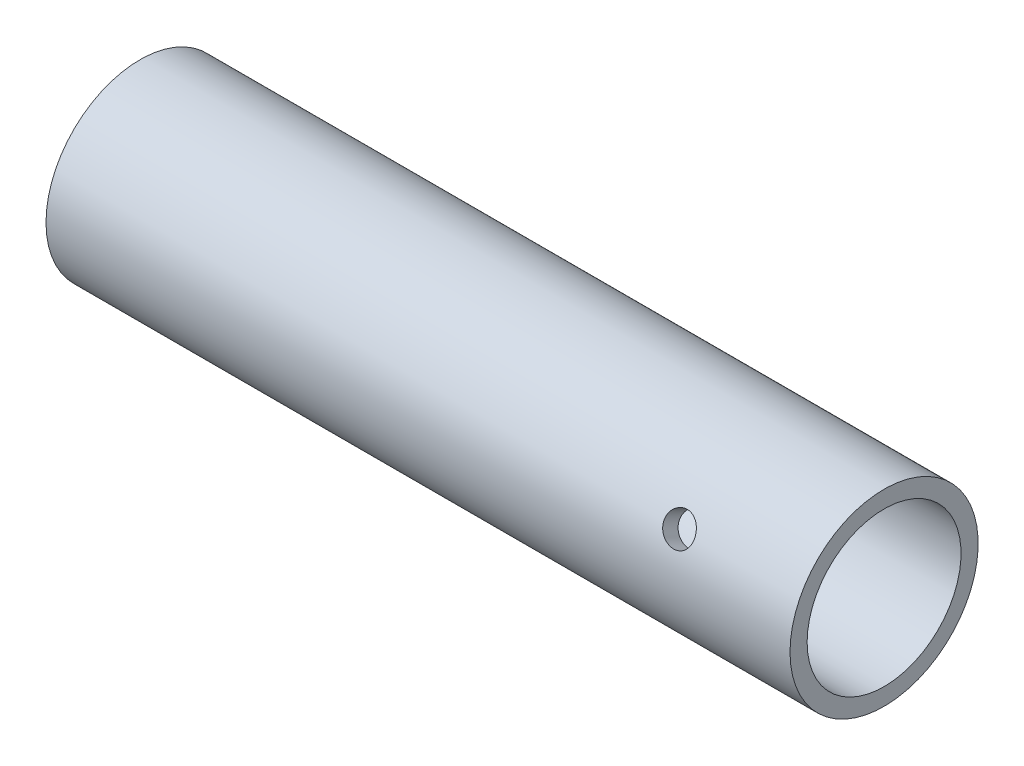
ISO-10303-21;
HEADER;
FILE_DESCRIPTION(('STEP AP214'),'2;1');
FILE_NAME('part.step','',(''),(''),'','','');
FILE_SCHEMA(('AUTOMOTIVE_DESIGN { 1 0 10303 214 1 1 1 1 }'));
ENDSEC;
DATA;
#1=APPLICATION_CONTEXT('core data for automotive mechanical design processes');
#2=APPLICATION_PROTOCOL_DEFINITION('international standard','automotive_design',2000,#1);
#3=PRODUCT_CONTEXT('',#1,'mechanical');
#4=PRODUCT('Part','Part','',(#3));
#5=PRODUCT_RELATED_PRODUCT_CATEGORY('part','',(#4));
#6=PRODUCT_DEFINITION_FORMATION('','',#4);
#7=PRODUCT_DEFINITION_CONTEXT('part definition',#1,'design');
#8=PRODUCT_DEFINITION('design','',#6,#7);
#9=PRODUCT_DEFINITION_SHAPE('','',#8);
#10=(LENGTH_UNIT() NAMED_UNIT(*) SI_UNIT(.MILLI.,.METRE.));
#11=(NAMED_UNIT(*) PLANE_ANGLE_UNIT() SI_UNIT($,.RADIAN.));
#12=(NAMED_UNIT(*) SI_UNIT($,.STERADIAN.) SOLID_ANGLE_UNIT());
#13=UNCERTAINTY_MEASURE_WITH_UNIT(LENGTH_MEASURE(1.E-05),#10,'distance_accuracy_value','');
#14=(GEOMETRIC_REPRESENTATION_CONTEXT(3) GLOBAL_UNCERTAINTY_ASSIGNED_CONTEXT((#13)) GLOBAL_UNIT_ASSIGNED_CONTEXT((#10,
#11,#12)) REPRESENTATION_CONTEXT('',''));
#15=CARTESIAN_POINT('',(0.,0.,0.));
#16=DIRECTION('',(0.,0.,1.));
#17=DIRECTION('',(1.,0.,0.));
#18=AXIS2_PLACEMENT_3D('',#15,#16,#17);
#19=CARTESIAN_POINT('',(261.558388757778,0.,0.));
#20=DIRECTION('',(-1.,0.,0.));
#21=DIRECTION('',(0.,0.,1.));
#22=AXIS2_PLACEMENT_3D('',#19,#20,#21);
#23=PLANE('',#22);
#24=CARTESIAN_POINT('',(261.558388757778,-148.573704322227,0.));
#25=DIRECTION('',(-1.,0.,0.));
#26=DIRECTION('',(0.,0.,1.));
#27=AXIS2_PLACEMENT_3D('',#24,#25,#26);
#28=CIRCLE('',#27,5.50000000000001);
#29=CARTESIAN_POINT('',(261.558388757778,-148.573704322227,5.50000000000001));
#30=VERTEX_POINT('',#29);
#31=EDGE_CURVE('E146',#30,#30,#28,.T.);
#32=ORIENTED_EDGE('',*,*,#31,.T.);
#33=EDGE_LOOP('',(#32));
#34=FACE_BOUND('',#33,.T.);
#35=CARTESIAN_POINT('',(261.558388757778,-148.573704322227,0.));
#36=DIRECTION('',(-1.,0.,0.));
#37=DIRECTION('',(0.,0.,1.));
#38=AXIS2_PLACEMENT_3D('',#35,#36,#37);
#39=CIRCLE('',#38,0.5);
#40=CARTESIAN_POINT('',(261.558388757778,-148.573704322227,0.5));
#41=VERTEX_POINT('',#40);
#42=EDGE_CURVE('E57',#41,#41,#39,.T.);
#43=ORIENTED_EDGE('',*,*,#42,.F.);
#44=EDGE_LOOP('',(#43));
#45=FACE_BOUND('',#44,.T.);
#46=ADVANCED_FACE('F44',(#34,#45),#23,.T.);
#47=CARTESIAN_POINT('',(263.058388757778,-148.573704322227,0.));
#48=DIRECTION('',(-1.,0.,0.));
#49=DIRECTION('',(0.,0.,1.));
#50=AXIS2_PLACEMENT_3D('',#47,#48,#49);
#51=CYLINDRICAL_SURFACE('',#50,0.5);
#52=ORIENTED_EDGE('',*,*,#42,.T.);
#53=EDGE_LOOP('',(#52));
#54=FACE_BOUND('',#53,.T.);
#55=CARTESIAN_POINT('',(263.058388757778,-148.573704322227,0.));
#56=DIRECTION('',(-1.,0.,0.));
#57=DIRECTION('',(0.,0.,1.));
#58=AXIS2_PLACEMENT_3D('',#55,#56,#57);
#59=CIRCLE('',#58,0.5);
#60=CARTESIAN_POINT('',(263.058388757778,-148.573704322227,0.5));
#61=VERTEX_POINT('',#60);
#62=EDGE_CURVE('E63',#61,#61,#59,.T.);
#63=ORIENTED_EDGE('',*,*,#62,.F.);
#64=EDGE_LOOP('',(#63));
#65=FACE_BOUND('',#64,.T.);
#66=ADVANCED_FACE('F111',(#54,#65),#51,.F.);
#67=CARTESIAN_POINT('',(263.058388757778,0.,0.));
#68=DIRECTION('',(-1.,0.,0.));
#69=DIRECTION('',(0.,0.,1.));
#70=AXIS2_PLACEMENT_3D('',#67,#68,#69);
#71=PLANE('',#70);
#72=CARTESIAN_POINT('',(263.058388757778,-148.573704322227,0.));
#73=DIRECTION('',(-1.,0.,0.));
#74=DIRECTION('',(0.,0.,1.));
#75=AXIS2_PLACEMENT_3D('',#72,#73,#74);
#76=CIRCLE('',#75,4.);
#77=CARTESIAN_POINT('',(263.058388757778,-148.573704322227,4.));
#78=VERTEX_POINT('',#77);
#79=EDGE_CURVE('E125',#78,#78,#76,.T.);
#80=ORIENTED_EDGE('',*,*,#79,.F.);
#81=EDGE_LOOP('',(#80));
#82=FACE_BOUND('',#81,.T.);
#83=ORIENTED_EDGE('',*,*,#62,.T.);
#84=EDGE_LOOP('',(#83));
#85=FACE_BOUND('',#84,.T.);
#86=ADVANCED_FACE('F108',(#82,#85),#71,.F.);
#87=CARTESIAN_POINT('',(263.058388757778,-148.573704322227,0.));
#88=DIRECTION('',(-1.,0.,0.));
#89=DIRECTION('',(0.,0.,1.));
#90=AXIS2_PLACEMENT_3D('',#87,#88,#89);
#91=CYLINDRICAL_SURFACE('',#90,4.);
#92=CARTESIAN_POINT('',(295.058388757778,-148.573704322227,0.));
#93=DIRECTION('',(-1.,0.,0.));
#94=DIRECTION('',(0.,0.,1.));
#95=AXIS2_PLACEMENT_3D('',#92,#93,#94);
#96=CIRCLE('',#95,4.);
#97=CARTESIAN_POINT('',(295.058388757778,-148.573704322227,4.));
#98=VERTEX_POINT('',#97);
#99=EDGE_CURVE('E130',#98,#98,#96,.T.);
#100=ORIENTED_EDGE('',*,*,#99,.F.);
#101=EDGE_LOOP('',(#100));
#102=FACE_BOUND('',#101,.T.);
#103=ORIENTED_EDGE('',*,*,#79,.T.);
#104=EDGE_LOOP('',(#103));
#105=FACE_BOUND('',#104,.T.);
#106=ADVANCED_FACE('F104',(#102,#105),#91,.F.);
#107=CARTESIAN_POINT('',(295.058388757778,0.,0.));
#108=DIRECTION('',(-1.,0.,0.));
#109=DIRECTION('',(0.,0.,1.));
#110=AXIS2_PLACEMENT_3D('',#107,#108,#109);
#111=PLANE('',#110);
#112=CARTESIAN_POINT('',(295.058388757778,-148.573704322227,0.));
#113=DIRECTION('',(-1.,0.,0.));
#114=DIRECTION('',(0.,0.,1.));
#115=AXIS2_PLACEMENT_3D('',#112,#113,#114);
#116=CIRCLE('',#115,4.5);
#117=CARTESIAN_POINT('',(295.058388757778,-148.573704322227,4.5));
#118=VERTEX_POINT('',#117);
#119=EDGE_CURVE('E136',#118,#118,#116,.T.);
#120=ORIENTED_EDGE('',*,*,#119,.F.);
#121=EDGE_LOOP('',(#120));
#122=FACE_BOUND('',#121,.T.);
#123=ORIENTED_EDGE('',*,*,#99,.T.);
#124=EDGE_LOOP('',(#123));
#125=FACE_BOUND('',#124,.T.);
#126=ADVANCED_FACE('F99',(#122,#125),#111,.F.);
#127=CARTESIAN_POINT('',(263.058388757778,-148.573704322227,0.));
#128=DIRECTION('',(-1.,0.,0.));
#129=DIRECTION('',(0.,0.,1.));
#130=AXIS2_PLACEMENT_3D('',#127,#128,#129);
#131=CYLINDRICAL_SURFACE('',#130,4.5);
#132=CARTESIAN_POINT('',(298.024345503325,-151.325180708403,-3.5608113817385));
#133=CARTESIAN_POINT('',(297.974337565391,-151.325179487366,-3.56081308925363));
#134=CARTESIAN_POINT('',(297.924306342349,-151.321805976729,-3.56342694902663));
#135=CARTESIAN_POINT('',(297.825659248718,-151.308380440811,-3.57373970951944));
#136=CARTESIAN_POINT('',(297.777044543157,-151.298323071642,-3.58144267906346));
#137=CARTESIAN_POINT('',(297.682671930298,-151.27176073818,-3.60149502460339));
#138=CARTESIAN_POINT('',(297.636911233943,-151.25526218672,-3.61383977879568));
#139=CARTESIAN_POINT('',(297.549438143099,-151.216162800501,-3.64252639047881));
#140=CARTESIAN_POINT('',(297.507725522841,-151.193562306326,-3.65886802487634));
#141=CARTESIAN_POINT('',(297.428940599855,-151.142386564057,-3.69497793568521));
#142=CARTESIAN_POINT('',(297.391933874229,-151.113739160253,-3.71478705097223));
#143=CARTESIAN_POINT('',(297.324183723104,-151.051233065395,-3.75676270188654));
#144=CARTESIAN_POINT('',(297.293440736649,-151.017374009333,-3.77892940259834));
#145=CARTESIAN_POINT('',(297.238836287459,-150.944854330806,-3.82485329986829));
#146=CARTESIAN_POINT('',(297.21503714089,-150.906154429375,-3.84862267542516));
#147=CARTESIAN_POINT('',(297.175398059981,-150.825111762915,-3.8965855194698));
#148=CARTESIAN_POINT('',(297.159557380614,-150.782769339314,-3.92077894804049));
#149=CARTESIAN_POINT('',(297.136489029067,-150.696125994574,-3.96834163127393));
#150=CARTESIAN_POINT('',(297.129150623511,-150.651858228956,-3.99171754506874));
#151=CARTESIAN_POINT('',(297.12294964667,-150.562088861675,-4.03718431421408));
#152=CARTESIAN_POINT('',(297.124086258643,-150.516587379325,-4.05927529318774));
#153=CARTESIAN_POINT('',(297.134719065518,-150.426340750113,-4.10124137574189));
#154=CARTESIAN_POINT('',(297.144095982776,-150.381594060146,-4.12114355509993));
#155=CARTESIAN_POINT('',(297.170754032538,-150.293523498529,-4.15866742202634));
#156=CARTESIAN_POINT('',(297.188035481297,-150.250199683882,-4.17628901831397));
#157=CARTESIAN_POINT('',(297.230122539457,-150.166003557219,-4.2091138934473));
#158=CARTESIAN_POINT('',(297.254974879319,-150.125148414996,-4.22430123237828));
#159=CARTESIAN_POINT('',(297.311463672837,-150.0474265026,-4.25204049156545));
#160=CARTESIAN_POINT('',(297.343100907118,-150.010560192087,-4.26459210824419));
#161=CARTESIAN_POINT('',(297.412915763222,-149.941362259278,-4.28729088838027));
#162=CARTESIAN_POINT('',(297.451197771381,-149.909120875615,-4.29739232953598));
#163=CARTESIAN_POINT('',(297.53287030153,-149.851033062093,-4.31501511751865));
#164=CARTESIAN_POINT('',(297.576260920119,-149.825186753188,-4.32253641554693));
#165=CARTESIAN_POINT('',(297.667064251964,-149.780763992802,-4.33515211828133));
#166=CARTESIAN_POINT('',(297.7144853742,-149.76220321797,-4.34024129472863));
#167=CARTESIAN_POINT('',(297.811919694676,-149.733147977461,-4.34809374616846));
#168=CARTESIAN_POINT('',(297.861932554182,-149.722652460497,-4.35085732430163));
#169=CARTESIAN_POINT('',(297.962213875524,-149.710258524392,-4.35411131709283));
#170=CARTESIAN_POINT('',(298.012463320204,-149.708216071313,-4.35463981922662));
#171=CARTESIAN_POINT('',(298.112588904204,-149.712414677733,-4.35354376125438));
#172=CARTESIAN_POINT('',(298.162465064532,-149.718655267515,-4.35191932323788));
#173=CARTESIAN_POINT('',(298.259937279588,-149.739069638718,-4.3464965564696));
#174=CARTESIAN_POINT('',(298.307550612057,-149.753166775759,-4.34271922229974));
#175=CARTESIAN_POINT('',(298.39970245445,-149.788708463296,-4.33290926963758));
#176=CARTESIAN_POINT('',(298.444240710717,-149.810153619051,-4.32687646535776));
#177=CARTESIAN_POINT('',(298.52961730228,-149.859958357799,-4.3123346065133));
#178=CARTESIAN_POINT('',(298.570399844995,-149.888404422082,-4.30379430070768));
#179=CARTESIAN_POINT('',(298.646522984125,-149.951100849852,-4.28414001138145));
#180=CARTESIAN_POINT('',(298.681863019749,-149.985351810707,-4.27302576293916));
#181=CARTESIAN_POINT('',(298.746651806592,-150.059125953844,-4.24794781845924));
#182=CARTESIAN_POINT('',(298.77600179251,-150.09872199877,-4.23394299958724));
#183=CARTESIAN_POINT('',(298.827276796674,-150.181502351108,-4.20320496384247));
#184=CARTESIAN_POINT('',(298.849202126735,-150.224686507734,-4.18647186159344));
#185=CARTESIAN_POINT('',(298.884861487897,-150.313025911255,-4.15054441615511));
#186=CARTESIAN_POINT('',(298.898641969728,-150.35816837308,-4.13136480363366));
#187=CARTESIAN_POINT('',(298.917767626222,-150.449250240534,-4.09082024818591));
#188=CARTESIAN_POINT('',(298.923113816853,-150.495189549502,-4.06945556879616));
#189=CARTESIAN_POINT('',(298.925179786191,-150.58567234346,-4.02547780298625));
#190=CARTESIAN_POINT('',(298.922048055735,-150.630226206963,-4.00289290955076));
#191=CARTESIAN_POINT('',(298.907574947832,-150.71750268239,-3.95683760349906));
#192=CARTESIAN_POINT('',(298.896233673611,-150.760225317332,-3.93336720202083));
#193=CARTESIAN_POINT('',(298.865729410442,-150.842626608376,-3.88641701301321));
#194=CARTESIAN_POINT('',(298.846584263006,-150.882311964221,-3.86293736814019));
#195=CARTESIAN_POINT('',(298.801034486127,-150.957807455327,-3.81680648061171));
#196=CARTESIAN_POINT('',(298.774629283011,-150.993617284042,-3.79415530358001));
#197=CARTESIAN_POINT('',(298.714808054969,-151.061126893735,-3.75025046831244));
#198=CARTESIAN_POINT('',(298.681285800576,-151.092751049986,-3.72902525052818));
#199=CARTESIAN_POINT('',(298.608400287238,-151.150543836463,-3.68932654823204));
#200=CARTESIAN_POINT('',(298.569035646803,-151.17671117284,-3.67085371662493));
#201=CARTESIAN_POINT('',(298.485074118294,-151.223300348617,-3.63737200260856));
#202=CARTESIAN_POINT('',(298.44042543828,-151.243657264214,-3.62240257551002));
#203=CARTESIAN_POINT('',(298.347506007355,-151.277798256743,-3.5969893781746));
#204=CARTESIAN_POINT('',(298.299238588497,-151.291588296327,-3.58654150320726));
#205=CARTESIAN_POINT('',(298.213109293432,-151.309661817043,-3.57276196233858));
#206=CARTESIAN_POINT('',(298.175738625764,-151.315473819414,-3.56829428018283));
#207=CARTESIAN_POINT('',(298.100364944226,-151.323233662607,-3.56231839186269));
#208=CARTESIAN_POINT('',(298.062361952201,-151.325181636644,-3.56081008367134));
#209=CARTESIAN_POINT('',(298.024345503325,-151.325180708403,-3.5608113817385));
#210=B_SPLINE_CURVE_WITH_KNOTS('',3,(#132,#133,#134,#135,#136,#137,#138,#139,#140,#141,#142,
#143,#144,#145,#146,#147,#148,#149,#150,#151,#152,#153,#154,#155,#156,#157,#158,#159,#160,#161,
#162,#163,#164,#165,#166,#167,#168,#169,#170,#171,#172,#173,#174,#175,#176,#177,#178,#179,#180,
#181,#182,#183,#184,#185,#186,#187,#188,#189,#190,#191,#192,#193,#194,#195,#196,#197,#198,#199,
#200,#201,#202,#203,#204,#205,#206,#207,#208,#209),.UNSPECIFIED.,.T.,.F.,(4,2,2,2,2,2,2,2,2,2,2,
2,2,2,2,2,2,2,2,2,2,2,2,2,2,2,2,2,2,2,2,2,2,2,2,2,2,2,4),(0.,0.149884617470893,
0.299889215333309,0.449744848123922,0.599592118351347,0.751340272913418,0.903099060296251,
1.05618060391445,1.20924781419646,1.36029823992516,1.51133410902368,1.66021910667929,
1.8091100616412,1.95893931797817,2.10878582190802,2.26124412083977,2.41370530308195,
2.56649276853244,2.71926031512168,2.86941382021882,3.01955881073331,3.16826407602735,
3.31698159316704,3.46763753794822,3.61830899580932,3.77129341557854,3.92427140964842,
4.07636832218533,4.22844691220213,4.37787915670964,4.52730952227829,4.67640015365657,
4.82550256918965,4.97701036820784,5.12855404998549,5.28173008718878,5.43476677577781,
5.54871423270953,5.66265776113543),.UNSPECIFIED.);
#211=CARTESIAN_POINT('',(298.024345503325,-151.325180708403,-3.5608113817385));
#212=VERTEX_POINT('',#211);
#213=EDGE_CURVE('E89',#212,#212,#210,.T.);
#214=ORIENTED_EDGE('',*,*,#213,.T.);
#215=EDGE_LOOP('',(#214));
#216=FACE_BOUND('',#215,.T.);
#217=CARTESIAN_POINT('',(298.024345503325,-147.437893399834,4.35430058087094));
#218=CARTESIAN_POINT('',(298.074353441258,-147.437891302093,4.3543006584609));
#219=CARTESIAN_POINT('',(298.1243846643,-147.433760411546,4.35322894011158));
#220=CARTESIAN_POINT('',(298.223031757931,-147.417391641382,4.3489090550466));
#221=CARTESIAN_POINT('',(298.271646463492,-147.405147274889,4.34565914680336));
#222=CARTESIAN_POINT('',(298.366019076351,-147.373039844229,4.33689746791208));
#223=CARTESIAN_POINT('',(298.411779772706,-147.353184358037,4.33138794665686));
#224=CARTESIAN_POINT('',(298.49925286355,-147.306579628293,4.31798336318693));
#225=CARTESIAN_POINT('',(298.540965483808,-147.279830769502,4.31008843411242));
#226=CARTESIAN_POINT('',(298.619750406794,-147.219968702417,4.29166521018968));
#227=CARTESIAN_POINT('',(298.65675713242,-147.186779063767,4.28110478029914));
#228=CARTESIAN_POINT('',(298.724507283546,-147.115348322401,4.25730107571439));
#229=CARTESIAN_POINT('',(298.75525027,-147.077106865897,4.24405761308815));
#230=CARTESIAN_POINT('',(298.80985471919,-146.996429886652,4.21474322866527));
#231=CARTESIAN_POINT('',(298.83365386576,-146.953960712962,4.19864866836665));
#232=CARTESIAN_POINT('',(298.873292946668,-146.866459715379,4.1638359750251));
#233=CARTESIAN_POINT('',(298.889133626035,-146.821428131804,4.14511808777372));
#234=CARTESIAN_POINT('',(298.912201977582,-146.730819875121,4.10562857213917));
#235=CARTESIAN_POINT('',(298.919540383138,-146.685258201583,4.08488725292225));
#236=CARTESIAN_POINT('',(298.925741359979,-146.59439750976,4.04164258758386));
#237=CARTESIAN_POINT('',(298.924604748006,-146.549098466588,4.01913941146038));
#238=CARTESIAN_POINT('',(298.913971941131,-146.460716328974,3.97337693862526));
#239=CARTESIAN_POINT('',(298.904595023873,-146.417610864316,3.95013297332698));
#240=CARTESIAN_POINT('',(298.877936974112,-146.334074468253,3.90337685131555));
#241=CARTESIAN_POINT('',(298.860655525352,-146.293643643934,3.87986468390853));
#242=CARTESIAN_POINT('',(298.818568467192,-146.216194477567,3.83330196489847));
#243=CARTESIAN_POINT('',(298.79371612733,-146.179199246452,3.81025525614079));
#244=CARTESIAN_POINT('',(298.737227333812,-146.109732626681,3.76570695758194));
#245=CARTESIAN_POINT('',(298.705590099531,-146.077261759277,3.74420554595252));
#246=CARTESIAN_POINT('',(298.635775243427,-146.016995075001,3.70332137675327));
#247=CARTESIAN_POINT('',(298.597493235268,-145.989290607923,3.68398207899208));
#248=CARTESIAN_POINT('',(298.515820705119,-145.939832980182,3.64878691179098));
#249=CARTESIAN_POINT('',(298.47243008653,-145.918079932081,3.63293110823702));
#250=CARTESIAN_POINT('',(298.381626754685,-145.880938769998,3.60548895681216));
#251=CARTESIAN_POINT('',(298.334205632449,-145.865564377284,3.59391181865276));
#252=CARTESIAN_POINT('',(298.236771311973,-145.841587509246,3.57571902354709));
#253=CARTESIAN_POINT('',(298.186758452467,-145.83298415133,3.56910271997058));
#254=CARTESIAN_POINT('',(298.086477131125,-145.822832111524,3.56128388316287));
#255=CARTESIAN_POINT('',(298.036227686445,-145.821165234424,3.55999065084798));
#256=CARTESIAN_POINT('',(297.936102102445,-145.824599404207,3.56264321882087));
#257=CARTESIAN_POINT('',(297.886225942118,-145.829700067314,3.56658872202899));
#258=CARTESIAN_POINT('',(297.788753727062,-145.846471634388,3.57942879558522));
#259=CARTESIAN_POINT('',(297.741140394592,-145.858079067985,3.58827554704888));
#260=CARTESIAN_POINT('',(297.648988552199,-145.887570477053,3.61040479275333));
#261=CARTESIAN_POINT('',(297.604450295932,-145.905454969569,3.62368765239549));
#262=CARTESIAN_POINT('',(297.519073704369,-145.947410658559,3.65421137794943));
#263=CARTESIAN_POINT('',(297.478291161654,-145.971559455897,3.67150157701125));
#264=CARTESIAN_POINT('',(297.402168022524,-146.025442186822,3.7091019021715));
#265=CARTESIAN_POINT('',(297.3668279869,-146.055176695255,3.72941233904924));
#266=CARTESIAN_POINT('',(297.302039200057,-146.120123801536,3.77246348166703));
#267=CARTESIAN_POINT('',(297.27268921414,-146.155413486633,3.79523670829717));
#268=CARTESIAN_POINT('',(297.221414209975,-146.230345675984,3.84195480515101));
#269=CARTESIAN_POINT('',(297.199488879914,-146.269987997347,3.86589962612278));
#270=CARTESIAN_POINT('',(297.163829518753,-146.352425394038,3.91384446084897));
#271=CARTESIAN_POINT('',(297.150049036921,-146.395200995959,3.93784336241643));
#272=CARTESIAN_POINT('',(297.130923380427,-146.482968801854,3.98513585445903));
#273=CARTESIAN_POINT('',(297.125577189796,-146.527960738183,4.00842952955196));
#274=CARTESIAN_POINT('',(297.123511220458,-146.618079231296,4.05314906764123));
#275=CARTESIAN_POINT('',(297.126642950914,-146.663189821936,4.07460037941262));
#276=CARTESIAN_POINT('',(297.141116058818,-146.752992251118,4.11551245698736));
#277=CARTESIAN_POINT('',(297.152457333038,-146.797684094918,4.13497324781614));
#278=CARTESIAN_POINT('',(297.182961596207,-146.88521429661,4.17148018969455));
#279=CARTESIAN_POINT('',(297.202106743643,-146.928056637446,4.18853172990496));
#280=CARTESIAN_POINT('',(297.247656520522,-147.010716662543,4.22007452959915));
#281=CARTESIAN_POINT('',(297.274061723638,-147.050534107467,4.23456558661128));
#282=CARTESIAN_POINT('',(297.33388295168,-147.12655040134,4.26114951082322));
#283=CARTESIAN_POINT('',(297.367405206073,-147.162680510869,4.2731999180347));
#284=CARTESIAN_POINT('',(297.440290719411,-147.229427906421,4.29466566562796));
#285=CARTESIAN_POINT('',(297.479655359846,-147.260043884773,4.30408038125062));
#286=CARTESIAN_POINT('',(297.563616888355,-147.31502212285,4.3204806803634));
#287=CARTESIAN_POINT('',(297.608265568369,-147.339313468298,4.32743900606621));
#288=CARTESIAN_POINT('',(297.701184999294,-147.380296451951,4.33892086221355));
#289=CARTESIAN_POINT('',(297.749452418153,-147.396994983723,4.34344660190208));
#290=CARTESIAN_POINT('',(297.835581713217,-147.418948757144,4.34932535433718));
#291=CARTESIAN_POINT('',(297.872952380885,-147.42603745359,4.35119349194274));
#292=CARTESIAN_POINT('',(297.948326062423,-147.435510491204,4.35368105419285));
#293=CARTESIAN_POINT('',(297.986329054448,-147.437894994554,4.35430052188641));
#294=CARTESIAN_POINT('',(298.024345503325,-147.437893399834,4.35430058087094));
#295=B_SPLINE_CURVE_WITH_KNOTS('',3,(#217,#218,#219,#220,#221,#222,#223,#224,#225,#226,#227,
#228,#229,#230,#231,#232,#233,#234,#235,#236,#237,#238,#239,#240,#241,#242,#243,#244,#245,#246,
#247,#248,#249,#250,#251,#252,#253,#254,#255,#256,#257,#258,#259,#260,#261,#262,#263,#264,#265,
#266,#267,#268,#269,#270,#271,#272,#273,#274,#275,#276,#277,#278,#279,#280,#281,#282,#283,#284,
#285,#286,#287,#288,#289,#290,#291,#292,#293,#294),.UNSPECIFIED.,.T.,.F.,(4,2,2,2,2,2,2,2,2,2,2,
2,2,2,2,2,2,2,2,2,2,2,2,2,2,2,2,2,2,2,2,2,2,2,2,2,2,2,4),(0.,0.149884617470836,
0.299889215333304,0.449744848123928,0.599592118351356,0.751340272913467,0.903099060296257,
1.05618060391447,1.20924781419648,1.36029823992515,1.51133410902364,1.66021910667927,
1.80911006164118,1.95893931797817,2.10878582190802,2.26124412083978,2.41370530308195,
2.56649276853244,2.71926031512162,2.86941382021882,3.01955881073326,3.16826407602729,
3.31698159316697,3.46763753794814,3.61830899580932,3.77129341557855,3.92427140964842,
4.07636832218533,4.22844691220212,4.37787915670965,4.52730952227825,4.67640015365652,
4.82550256918966,4.97701036820784,5.1285540499855,5.28173008718878,5.43476677577782,
5.54871423270953,5.66265776113543),.UNSPECIFIED.);
#296=CARTESIAN_POINT('',(298.024345503325,-147.437893399834,4.35430058087094));
#297=VERTEX_POINT('',#296);
#298=EDGE_CURVE('E82',#297,#297,#295,.T.);
#299=ORIENTED_EDGE('',*,*,#298,.T.);
#300=EDGE_LOOP('',(#299));
#301=FACE_BOUND('',#300,.T.);
#302=CARTESIAN_POINT('',(305.058388757778,-148.573704322227,0.));
#303=DIRECTION('',(-1.,0.,0.));
#304=DIRECTION('',(0.,0.,1.));
#305=AXIS2_PLACEMENT_3D('',#302,#303,#304);
#306=CIRCLE('',#305,4.5);
#307=CARTESIAN_POINT('',(305.058388757778,-148.573704322227,4.5));
#308=VERTEX_POINT('',#307);
#309=EDGE_CURVE('E140',#308,#308,#306,.T.);
#310=ORIENTED_EDGE('',*,*,#309,.F.);
#311=EDGE_LOOP('',(#310));
#312=FACE_BOUND('',#311,.T.);
#313=ORIENTED_EDGE('',*,*,#119,.T.);
#314=EDGE_LOOP('',(#313));
#315=FACE_BOUND('',#314,.T.);
#316=ADVANCED_FACE('F94',(#216,#301,#312,#315),#131,.F.);
#317=CARTESIAN_POINT('',(305.058388757778,0.,0.));
#318=DIRECTION('',(-1.,0.,0.));
#319=DIRECTION('',(0.,0.,1.));
#320=AXIS2_PLACEMENT_3D('',#317,#318,#319);
#321=PLANE('',#320);
#322=CARTESIAN_POINT('',(305.058388757778,-148.573704322227,0.));
#323=DIRECTION('',(-1.,0.,0.));
#324=DIRECTION('',(0.,0.,1.));
#325=AXIS2_PLACEMENT_3D('',#322,#323,#324);
#326=CIRCLE('',#325,5.50000000000001);
#327=CARTESIAN_POINT('',(305.058388757778,-148.573704322227,5.50000000000001));
#328=VERTEX_POINT('',#327);
#329=EDGE_CURVE('E143',#328,#328,#326,.T.);
#330=ORIENTED_EDGE('',*,*,#329,.F.);
#331=EDGE_LOOP('',(#330));
#332=FACE_BOUND('',#331,.T.);
#333=ORIENTED_EDGE('',*,*,#309,.T.);
#334=EDGE_LOOP('',(#333));
#335=FACE_BOUND('',#334,.T.);
#336=ADVANCED_FACE('F98',(#332,#335),#321,.F.);
#337=CARTESIAN_POINT('',(263.058388757778,-148.573704322227,0.));
#338=DIRECTION('',(-1.,0.,0.));
#339=DIRECTION('',(0.,0.,1.));
#340=AXIS2_PLACEMENT_3D('',#337,#338,#339);
#341=CYLINDRICAL_SURFACE('',#340,5.50000000000001);
#342=CARTESIAN_POINT('',(298.024345503325,-151.773406203702,-4.47346709719525));
#343=CARTESIAN_POINT('',(297.974156557219,-151.773404777524,-4.47346879447268));
#344=CARTESIAN_POINT('',(297.923939875965,-151.769935463772,-4.47595587816864));
#345=CARTESIAN_POINT('',(297.824914559823,-151.75612958702,-4.48578181438356));
#346=CARTESIAN_POINT('',(297.776107281926,-151.74578662185,-4.49312519005792));
#347=CARTESIAN_POINT('',(297.68134826817,-151.718477691048,-4.51228065682102));
#348=CARTESIAN_POINT('',(297.635394218832,-151.701517174603,-4.5240890709514));
#349=CARTESIAN_POINT('',(297.54757133804,-151.661352510584,-4.55159514855058));
#350=CARTESIAN_POINT('',(297.50570202829,-151.638149095212,-4.56729235590337));
#351=CARTESIAN_POINT('',(297.426833859571,-151.585779314774,-4.60199919593256));
#352=CARTESIAN_POINT('',(297.389879463522,-151.556563902153,-4.62103587139303));
#353=CARTESIAN_POINT('',(297.322276149414,-151.492941195773,-4.66148843264914));
#354=CARTESIAN_POINT('',(297.291627599837,-151.458533598814,-4.68290445736925));
#355=CARTESIAN_POINT('',(297.237339621703,-151.385106850761,-4.72735288501421));
#356=CARTESIAN_POINT('',(297.213741493632,-151.346062329582,-4.75039387120297));
#357=CARTESIAN_POINT('',(297.174489606077,-151.264489846517,-4.7970698105052));
#358=CARTESIAN_POINT('',(297.158835348456,-151.221962103249,-4.82070472627757));
#359=CARTESIAN_POINT('',(297.136051337993,-151.134942555995,-4.86749177702957));
#360=CARTESIAN_POINT('',(297.128846922522,-151.090471612161,-4.89064633689597));
#361=CARTESIAN_POINT('',(297.122934997698,-151.000457610748,-4.93593009085939));
#362=CARTESIAN_POINT('',(297.124226930703,-150.954914623725,-4.95805935215403));
#363=CARTESIAN_POINT('',(297.13521267161,-150.864519268105,-5.00046364539137));
#364=CARTESIAN_POINT('',(297.144826133028,-150.819664457538,-5.02075436540914));
#365=CARTESIAN_POINT('',(297.172055598317,-150.731522438264,-5.05926235646901));
#366=CARTESIAN_POINT('',(297.189671838985,-150.688235275984,-5.07747956613712));
#367=CARTESIAN_POINT('',(297.232487105802,-150.604333420702,-5.1116150060625));
#368=CARTESIAN_POINT('',(297.257719374582,-150.563731414849,-5.12752269545355));
#369=CARTESIAN_POINT('',(297.315026107551,-150.486641389096,-5.15677945738802));
#370=CARTESIAN_POINT('',(297.347101106015,-150.450153690779,-5.1701283299861));
#371=CARTESIAN_POINT('',(297.417628814257,-150.382027062365,-5.19435210784849));
#372=CARTESIAN_POINT('',(297.456151734018,-150.350449838919,-5.20519624952387));
#373=CARTESIAN_POINT('',(297.538244823875,-150.29370131062,-5.22422328633677));
#374=CARTESIAN_POINT('',(297.581815037332,-150.268530060806,-5.23240615860876));
#375=CARTESIAN_POINT('',(297.672844345568,-150.225436782245,-5.2461695189059));
#376=CARTESIAN_POINT('',(297.720307478465,-150.20752239837,-5.25174726345431));
#377=CARTESIAN_POINT('',(297.817731904565,-150.179633134245,-5.26034292382921));
#378=CARTESIAN_POINT('',(297.867692985828,-150.169657581628,-5.26336105643932));
#379=CARTESIAN_POINT('',(297.968078844297,-150.158087663157,-5.26685542288271));
#380=CARTESIAN_POINT('',(298.018491653965,-150.156398093083,-5.26736053181798));
#381=CARTESIAN_POINT('',(298.118888196654,-150.161205505763,-5.26591360102672));
#382=CARTESIAN_POINT('',(298.168871945556,-150.167702184184,-5.26396165264367));
#383=CARTESIAN_POINT('',(298.266681086876,-150.188574769028,-5.2575954660525));
#384=CARTESIAN_POINT('',(298.31451774099,-150.202902598304,-5.25319624925654));
#385=CARTESIAN_POINT('',(298.407031782527,-150.238893177491,-5.24189848265394));
#386=CARTESIAN_POINT('',(298.451708986925,-150.260556351917,-5.23499978819448));
#387=CARTESIAN_POINT('',(298.537073478101,-150.310703116922,-5.21857594170613));
#388=CARTESIAN_POINT('',(298.577721694372,-150.339245721986,-5.20902794947562));
#389=CARTESIAN_POINT('',(298.653470860067,-150.402107049572,-5.18729667089772));
#390=CARTESIAN_POINT('',(298.688571433603,-150.436426163165,-5.17511320611251));
#391=CARTESIAN_POINT('',(298.752586344163,-150.510122855327,-5.14799352157706));
#392=CARTESIAN_POINT('',(298.781435280302,-150.549547604699,-5.13303098225643));
#393=CARTESIAN_POINT('',(298.831670365891,-150.63194131225,-5.10055081279628));
#394=CARTESIAN_POINT('',(298.853056749953,-150.674910158956,-5.08303326300721));
#395=CARTESIAN_POINT('',(298.887657360101,-150.762871255906,-5.04577227118556));
#396=CARTESIAN_POINT('',(298.900906099614,-150.807854080303,-5.02603865556099));
#397=CARTESIAN_POINT('',(298.918966582066,-150.898641152942,-4.98469206084263));
#398=CARTESIAN_POINT('',(298.92377899315,-150.944445335845,-4.96307923072219));
#399=CARTESIAN_POINT('',(298.924811537373,-151.034977746043,-4.91880504369804));
#400=CARTESIAN_POINT('',(298.921131284319,-151.079712291717,-4.89615886603884));
#401=CARTESIAN_POINT('',(298.905498061628,-151.167397302068,-4.85027895644274));
#402=CARTESIAN_POINT('',(298.8935451343,-151.210347775868,-4.82704522751138));
#403=CARTESIAN_POINT('',(298.861743552554,-151.293283839325,-4.78080965721408));
#404=CARTESIAN_POINT('',(298.841903072629,-151.333272447855,-4.75780760097418));
#405=CARTESIAN_POINT('',(298.794900580801,-151.409350033151,-4.71286197009518));
#406=CARTESIAN_POINT('',(298.767738242141,-151.445438835778,-4.69091844274719));
#407=CARTESIAN_POINT('',(298.706508582818,-151.513257946551,-4.6487245068895));
#408=CARTESIAN_POINT('',(298.672368197392,-151.544935620303,-4.62849551479452));
#409=CARTESIAN_POINT('',(298.59830502363,-151.602748188854,-4.59086986192398));
#410=CARTESIAN_POINT('',(298.558380882692,-151.62888178357,-4.57347386570638));
#411=CARTESIAN_POINT('',(298.473562074801,-151.675177897784,-4.54220757226906));
#412=CARTESIAN_POINT('',(298.428635494741,-151.69529866324,-4.52836201988792));
#413=CARTESIAN_POINT('',(298.335321707811,-151.728857478771,-4.50504491574359));
#414=CARTESIAN_POINT('',(298.286938040173,-151.74230225444,-4.49556896260271));
#415=CARTESIAN_POINT('',(298.202691176517,-151.759284090378,-4.48354241819413));
#416=CARTESIAN_POINT('',(298.167340121586,-151.764573288262,-4.47977390001521));
#417=CARTESIAN_POINT('',(298.096112600645,-151.771634824807,-4.47473565399938));
#418=CARTESIAN_POINT('',(298.060236143626,-151.773407223576,-4.4734658834544));
#419=CARTESIAN_POINT('',(298.024345503325,-151.773406203702,-4.47346709719525));
#420=B_SPLINE_CURVE_WITH_KNOTS('',3,(#342,#343,#344,#345,#346,#347,#348,#349,#350,#351,#352,
#353,#354,#355,#356,#357,#358,#359,#360,#361,#362,#363,#364,#365,#366,#367,#368,#369,#370,#371,
#372,#373,#374,#375,#376,#377,#378,#379,#380,#381,#382,#383,#384,#385,#386,#387,#388,#389,#390,
#391,#392,#393,#394,#395,#396,#397,#398,#399,#400,#401,#402,#403,#404,#405,#406,#407,#408,#409,
#410,#411,#412,#413,#414,#415,#416,#417,#418,#419),.UNSPECIFIED.,.T.,.F.,(4,2,2,2,2,2,2,2,2,2,2,
2,2,2,2,2,2,2,2,2,2,2,2,2,2,2,2,2,2,2,2,2,2,2,2,2,2,2,4),(0.,0.15043560450601,0.301011522603146,
0.451463710562467,0.601898260353318,0.753612555565504,0.905335713669842,1.05793096506343,
1.21051664648834,1.3617436767699,1.51296078163665,1.66273392912541,1.8125115086091,
1.96295253437674,2.11340531078296,2.26561789026912,2.41783177752571,2.57020560276713,
2.72256652157978,2.87317267610218,3.02377323186187,3.17345943666684,3.32315430567892,
3.47418212718167,3.62522017740647,3.77776923221489,3.93031349066546,4.08220622765063,
4.23408693440928,4.38419524130205,4.53430278049206,4.68425515527595,4.83421422317684,
4.98583227264653,5.13748583727442,5.29016926326828,5.44269855766489,5.55027847064738,
5.65785654488108),.UNSPECIFIED.);
#421=CARTESIAN_POINT('',(298.024345503325,-151.773406203702,-4.47346709719525));
#422=VERTEX_POINT('',#421);
#423=EDGE_CURVE('E47',#422,#422,#420,.T.);
#424=ORIENTED_EDGE('',*,*,#423,.F.);
#425=EDGE_LOOP('',(#424));
#426=FACE_BOUND('',#425,.T.);
#427=CARTESIAN_POINT('',(298.024345503325,-146.989667904535,5.26695629632769));
#428=CARTESIAN_POINT('',(298.07453444943,-146.989665689484,5.26695620531688));
#429=CARTESIAN_POINT('',(298.124751130684,-146.98557655671,5.2657311680229));
#430=CARTESIAN_POINT('',(298.223776446826,-146.969360524254,5.26081267772905));
#431=CARTESIAN_POINT('',(298.272583724723,-146.957226131182,5.25711692346579));
#432=CARTESIAN_POINT('',(298.367342738479,-146.925372033285,5.24721611260639));
#433=CARTESIAN_POINT('',(298.413296787817,-146.9056585696,5.24101312043114));
#434=CARTESIAN_POINT('',(298.501119668609,-146.859336824899,5.22604380152686));
#435=CARTESIAN_POINT('',(298.542988978359,-146.832729352463,5.21727777539401));
#436=CARTESIAN_POINT('',(298.621857147078,-146.773247661731,5.19705187329944));
#437=CARTESIAN_POINT('',(298.658811543128,-146.740322057835,5.18556971516808));
#438=CARTESIAN_POINT('',(298.726414857235,-146.669414005897,5.15995123259179));
#439=CARTESIAN_POINT('',(298.757063406812,-146.631431262554,5.14581475313415));
#440=CARTESIAN_POINT('',(298.811351384946,-146.55136738979,5.11488052730475));
#441=CARTESIAN_POINT('',(298.834949513017,-146.509263958051,5.09806795122117));
#442=CARTESIAN_POINT('',(298.874201400572,-146.422457473844,5.06204923938043));
#443=CARTESIAN_POINT('',(298.889855658193,-146.377754584575,5.04284325380083));
#444=CARTESIAN_POINT('',(298.912639668656,-146.287530148556,5.00258184712725));
#445=CARTESIAN_POINT('',(298.919844084127,-146.24201943553,4.98154441648652));
#446=CARTESIAN_POINT('',(298.925756008951,-146.151154020472,4.93799427102408));
#447=CARTESIAN_POINT('',(298.924464075946,-146.105799308397,4.91548165311965));
#448=CARTESIAN_POINT('',(298.913478335039,-146.016979462922,4.86986938007071));
#449=CARTESIAN_POINT('',(298.903864873621,-145.973500421634,4.84677738322263));
#450=CARTESIAN_POINT('',(298.876635408332,-145.889141537982,4.8005663489767));
#451=CARTESIAN_POINT('',(298.859019167664,-145.848261772571,4.7774473107989));
#452=CARTESIAN_POINT('',(298.816203900847,-145.769955370253,4.73191867217544));
#453=CARTESIAN_POINT('',(298.790971632067,-145.732544831226,4.70951266783026));
#454=CARTESIAN_POINT('',(298.733664899098,-145.662263610389,4.66639213690718));
#455=CARTESIAN_POINT('',(298.701589900634,-145.629393283406,4.64567774258382));
#456=CARTESIAN_POINT('',(298.631062192392,-145.568574701549,4.60657366333547));
#457=CARTESIAN_POINT('',(298.592539272631,-145.540688515836,4.58821400387204));
#458=CARTESIAN_POINT('',(298.510446182774,-145.490938375174,4.55493717863078));
#459=CARTESIAN_POINT('',(298.466875969317,-145.469074471968,4.54002004243131));
#460=CARTESIAN_POINT('',(298.375846661081,-145.431837861361,4.51433160973578));
#461=CARTESIAN_POINT('',(298.328383528184,-145.416471998691,4.50356468592965));
#462=CARTESIAN_POINT('',(298.230959102084,-145.392619791238,4.48674896024399));
#463=CARTESIAN_POINT('',(298.180998020821,-145.384132863853,4.48069975880547));
#464=CARTESIAN_POINT('',(298.080612162352,-145.374294357506,4.47367997226095));
#465=CARTESIAN_POINT('',(298.030199352684,-145.372861725379,4.47265169833985));
#466=CARTESIAN_POINT('',(297.929802809995,-145.376945753175,4.47557155147773));
#467=CARTESIAN_POINT('',(297.879819061093,-145.382462154761,4.47951949354111));
#468=CARTESIAN_POINT('',(297.782009919773,-145.400260437793,4.49214542918603));
#469=CARTESIAN_POINT('',(297.73417326566,-145.412501040198,4.50079455937101));
#470=CARTESIAN_POINT('',(297.641659224122,-145.443444281347,4.52236947878178));
#471=CARTESIAN_POINT('',(297.596982019724,-145.46214729409,4.53529551552218));
#472=CARTESIAN_POINT('',(297.511617528548,-145.505801419513,4.56493936998564));
#473=CARTESIAN_POINT('',(297.470969312277,-145.530806685219,4.5816899265853));
#474=CARTESIAN_POINT('',(297.395220146582,-145.586433885315,4.61815099601751));
#475=CARTESIAN_POINT('',(297.360119573046,-145.617056199991,4.63786170924336));
#476=CARTESIAN_POINT('',(297.296104662486,-145.683571721078,4.67960335726313));
#477=CARTESIAN_POINT('',(297.267255726347,-145.719514593423,4.70165553115924));
#478=CARTESIAN_POINT('',(297.217020640758,-145.795589075952,4.74700261000856));
#479=CARTESIAN_POINT('',(297.195634256696,-145.835720554401,4.77029747586676));
#480=CARTESIAN_POINT('',(297.161033646548,-145.918981999609,4.81712767798102));
#481=CARTESIAN_POINT('',(297.147784907035,-145.96209842766,4.84066156224186));
#482=CARTESIAN_POINT('',(297.129724424583,-146.050320719645,4.88723044294679));
#483=CARTESIAN_POINT('',(297.124912013499,-146.095426425741,4.91026547875623));
#484=CARTESIAN_POINT('',(297.123879469276,-146.185809829075,4.95484306656281));
#485=CARTESIAN_POINT('',(297.12755972233,-146.231079376667,4.9763998984282));
#486=CARTESIAN_POINT('',(297.143192945021,-146.320992757811,5.0177425040082));
#487=CARTESIAN_POINT('',(297.155145872349,-146.365636594561,5.03752828678002));
#488=CARTESIAN_POINT('',(297.186947454095,-146.452928200344,5.07489530622839));
#489=CARTESIAN_POINT('',(297.20678793402,-146.495577984984,5.09247880057709));
#490=CARTESIAN_POINT('',(297.253790425848,-146.577655897071,5.12520684767793));
#491=CARTESIAN_POINT('',(297.280952764508,-146.617083880634,5.14035129153299));
#492=CARTESIAN_POINT('',(297.342182423831,-146.691935437873,5.16822608997614));
#493=CARTESIAN_POINT('',(297.376322809257,-146.72730988568,5.18092788425263));
#494=CARTESIAN_POINT('',(297.450385983019,-146.7924288338,5.20367662998036));
#495=CARTESIAN_POINT('',(297.490310123957,-146.822172013408,5.21372295886173));
#496=CARTESIAN_POINT('',(297.575128931848,-146.875217881728,5.23124571979734));
#497=CARTESIAN_POINT('',(297.620055511908,-146.898475462192,5.23870423668991));
#498=CARTESIAN_POINT('',(297.713369298838,-146.937443759177,5.25100680859609));
#499=CARTESIAN_POINT('',(297.761752966476,-146.953162070443,5.25585349526855));
#500=CARTESIAN_POINT('',(297.845999830132,-146.973061188549,5.26194000665221));
#501=CARTESIAN_POINT('',(297.881350885063,-146.979276977704,5.2638218431762));
#502=CARTESIAN_POINT('',(297.952578406004,-146.987581092428,5.26633000982609));
#503=CARTESIAN_POINT('',(297.988454863023,-146.989669488541,5.26695636141047));
#504=CARTESIAN_POINT('',(298.024345503325,-146.989667904535,5.26695629632769));
#505=B_SPLINE_CURVE_WITH_KNOTS('',3,(#427,#428,#429,#430,#431,#432,#433,#434,#435,#436,#437,
#438,#439,#440,#441,#442,#443,#444,#445,#446,#447,#448,#449,#450,#451,#452,#453,#454,#455,#456,
#457,#458,#459,#460,#461,#462,#463,#464,#465,#466,#467,#468,#469,#470,#471,#472,#473,#474,#475,
#476,#477,#478,#479,#480,#481,#482,#483,#484,#485,#486,#487,#488,#489,#490,#491,#492,#493,#494,
#495,#496,#497,#498,#499,#500,#501,#502,#503,#504),.UNSPECIFIED.,.T.,.F.,(4,2,2,2,2,2,2,2,2,2,2,
2,2,2,2,2,2,2,2,2,2,2,2,2,2,2,2,2,2,2,2,2,2,2,2,2,2,2,4),(0.,0.150435604506013,
0.301011522603149,0.451463710562526,0.601898260353309,0.753612555565498,0.905335713669831,
1.05793096506338,1.21051664648834,1.3617436767699,1.51296078163664,1.66273392912543,
1.8125115086091,1.96295253437674,2.11340531078297,2.26561789026919,2.41783177752576,
2.57020560276713,2.72256652157977,2.87317267610229,3.02377323186187,3.17345943666677,
3.32315430567894,3.47418212718173,3.62522017740655,3.77776923221497,3.93031349066543,
4.08220622765061,4.23408693440929,4.38419524130209,4.53430278049204,4.68425515527592,
4.83421422317685,4.98583227264653,5.13748583727438,5.29016926326825,5.44269855766496,
5.5502784706474,5.65785654488109),.UNSPECIFIED.);
#506=CARTESIAN_POINT('',(298.024345503325,-146.989667904535,5.26695629632769));
#507=VERTEX_POINT('',#506);
#508=EDGE_CURVE('E10',#507,#507,#505,.T.);
#509=ORIENTED_EDGE('',*,*,#508,.F.);
#510=EDGE_LOOP('',(#509));
#511=FACE_BOUND('',#510,.T.);
#512=ORIENTED_EDGE('',*,*,#329,.T.);
#513=EDGE_LOOP('',(#512));
#514=FACE_BOUND('',#513,.T.);
#515=ORIENTED_EDGE('',*,*,#31,.F.);
#516=EDGE_LOOP('',(#515));
#517=FACE_BOUND('',#516,.T.);
#518=ADVANCED_FACE('F69',(#426,#511,#514,#517),#341,.T.);
#519=CARTESIAN_POINT('',(298.024345503325,-151.818769174803,-6.60744874129836));
#520=DIRECTION('',(0.,0.440827332851372,0.897591924323713));
#521=DIRECTION('',(0.,-0.897591924323713,0.440827332851372));
#522=AXIS2_PLACEMENT_3D('',#519,#520,#521);
#523=CYLINDRICAL_SURFACE('',#522,0.900000000000003);
#524=ORIENTED_EDGE('',*,*,#508,.T.);
#525=EDGE_LOOP('',(#524));
#526=FACE_BOUND('',#525,.T.);
#527=ORIENTED_EDGE('',*,*,#298,.F.);
#528=EDGE_LOOP('',(#527));
#529=FACE_BOUND('',#528,.T.);
#530=ADVANCED_FACE('F75',(#526,#529),#523,.F.);
#531=ORIENTED_EDGE('',*,*,#423,.T.);
#532=EDGE_LOOP('',(#531));
#533=FACE_BOUND('',#532,.T.);
#534=ORIENTED_EDGE('',*,*,#213,.F.);
#535=EDGE_LOOP('',(#534));
#536=FACE_BOUND('',#535,.T.);
#537=ADVANCED_FACE('F72',(#533,#536),#523,.F.);
#538=CLOSED_SHELL('',(#46,#66,#86,#106,#126,#316,#336,#518,#530,#537));
#539=MANIFOLD_SOLID_BREP('B2',#538);
#540=ADVANCED_BREP_SHAPE_REPRESENTATION('',(#18,#539),#14);
#541=SHAPE_DEFINITION_REPRESENTATION(#9,#540);
ENDSEC;
END-ISO-10303-21;
